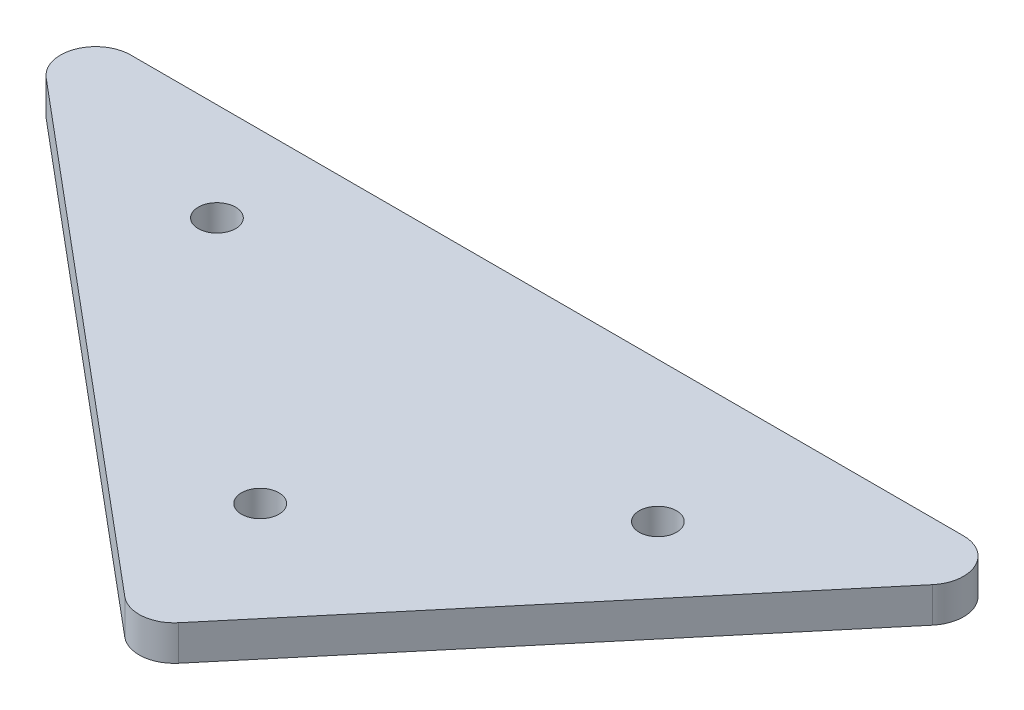
ISO-10303-21;
HEADER;
FILE_DESCRIPTION(('STEP AP214'),'2;1');
FILE_NAME('part.step','',(''),(''),'','','');
FILE_SCHEMA(('AUTOMOTIVE_DESIGN { 1 0 10303 214 1 1 1 1 }'));
ENDSEC;
DATA;
#1=APPLICATION_CONTEXT('core data for automotive mechanical design processes');
#2=APPLICATION_PROTOCOL_DEFINITION('international standard','automotive_design',2000,#1);
#3=PRODUCT_CONTEXT('',#1,'mechanical');
#4=PRODUCT('Part','Part','',(#3));
#5=PRODUCT_RELATED_PRODUCT_CATEGORY('part','',(#4));
#6=PRODUCT_DEFINITION_FORMATION('','',#4);
#7=PRODUCT_DEFINITION_CONTEXT('part definition',#1,'design');
#8=PRODUCT_DEFINITION('design','',#6,#7);
#9=PRODUCT_DEFINITION_SHAPE('','',#8);
#10=(LENGTH_UNIT() NAMED_UNIT(*) SI_UNIT(.MILLI.,.METRE.));
#11=(NAMED_UNIT(*) PLANE_ANGLE_UNIT() SI_UNIT($,.RADIAN.));
#12=(NAMED_UNIT(*) SI_UNIT($,.STERADIAN.) SOLID_ANGLE_UNIT());
#13=UNCERTAINTY_MEASURE_WITH_UNIT(LENGTH_MEASURE(1.E-05),#10,'distance_accuracy_value','');
#14=(GEOMETRIC_REPRESENTATION_CONTEXT(3) GLOBAL_UNCERTAINTY_ASSIGNED_CONTEXT((#13)) GLOBAL_UNIT_ASSIGNED_CONTEXT((#10,
#11,#12)) REPRESENTATION_CONTEXT('',''));
#15=CARTESIAN_POINT('',(0.,0.,0.));
#16=DIRECTION('',(0.,0.,1.));
#17=DIRECTION('',(1.,0.,0.));
#18=AXIS2_PLACEMENT_3D('',#15,#16,#17);
#19=CARTESIAN_POINT('',(189.795344434669,-158.75,127.));
#20=DIRECTION('',(0.,0.,1.));
#21=DIRECTION('',(1.,0.,0.));
#22=AXIS2_PLACEMENT_3D('',#19,#20,#21);
#23=PLANE('',#22);
#24=DIRECTION('',(-1.,0.,0.));
#25=VECTOR('',#24,1.);
#26=CARTESIAN_POINT('',(189.795344434669,-158.75,127.));
#27=LINE('',#26,#25);
#28=CARTESIAN_POINT('',(258.087229911123,-158.75,127.));
#29=VERTEX_POINT('',#28);
#30=CARTESIAN_POINT('',(107.476722517164,-158.75,127.));
#31=VERTEX_POINT('',#30);
#32=EDGE_CURVE('E104',#29,#31,#27,.T.);
#33=ORIENTED_EDGE('',*,*,#32,.F.);
#34=DIRECTION('',(0.,-1.,0.));
#35=VECTOR('',#34,1.);
#36=CARTESIAN_POINT('',(258.087229911123,-158.75,127.));
#37=LINE('',#36,#35);
#38=CARTESIAN_POINT('',(258.087229911123,-165.1,127.));
#39=VERTEX_POINT('',#38);
#40=EDGE_CURVE('E89',#29,#39,#37,.T.);
#41=ORIENTED_EDGE('',*,*,#40,.T.);
#42=DIRECTION('',(-1.,0.,0.));
#43=VECTOR('',#42,1.);
#44=CARTESIAN_POINT('',(189.795344434669,-165.1,127.));
#45=LINE('',#44,#43);
#46=CARTESIAN_POINT('',(107.476722517164,-165.1,127.));
#47=VERTEX_POINT('',#46);
#48=EDGE_CURVE('E102',#39,#47,#45,.T.);
#49=ORIENTED_EDGE('',*,*,#48,.T.);
#50=DIRECTION('',(0.,-1.,0.));
#51=VECTOR('',#50,1.);
#52=CARTESIAN_POINT('',(107.476722517164,-158.75,127.));
#53=LINE('',#52,#51);
#54=EDGE_CURVE('E107',#47,#31,#53,.F.);
#55=ORIENTED_EDGE('',*,*,#54,.T.);
#56=EDGE_LOOP('',(#33,#41,#49,#55));
#57=FACE_BOUND('',#56,.T.);
#58=ADVANCED_FACE('F14',(#57),#23,.F.);
#59=CARTESIAN_POINT('',(145.411840023669,-158.75,173.470679395635));
#60=DIRECTION('',(0.64278760968654,0.,-0.766044443118978));
#61=DIRECTION('',(-0.766044443118978,0.,-0.64278760968654));
#62=AXIS2_PLACEMENT_3D('',#59,#60,#61);
#63=PLANE('',#62);
#64=DIRECTION('',(0.766044443118978,0.,0.64278760968654));
#65=VECTOR('',#64,1.);
#66=CARTESIAN_POINT('',(145.411840023669,-165.1,173.470679395635));
#67=LINE('',#66,#65);
#68=CARTESIAN_POINT('',(103.395021195655,-165.1,138.214382213805));
#69=VERTEX_POINT('',#68);
#70=CARTESIAN_POINT('',(191.77689496586,-165.1,212.375579897142));
#71=VERTEX_POINT('',#70);
#72=EDGE_CURVE('E112',#69,#71,#67,.T.);
#73=ORIENTED_EDGE('',*,*,#72,.T.);
#74=DIRECTION('',(0.,-1.,0.));
#75=VECTOR('',#74,1.);
#76=CARTESIAN_POINT('',(191.77689496586,-158.75,212.375579897142));
#77=LINE('',#76,#75);
#78=CARTESIAN_POINT('',(191.77689496586,-158.75,212.375579897142));
#79=VERTEX_POINT('',#78);
#80=EDGE_CURVE('E9',#71,#79,#77,.F.);
#81=ORIENTED_EDGE('',*,*,#80,.T.);
#82=DIRECTION('',(0.766044443118978,0.,0.64278760968654));
#83=VECTOR('',#82,1.);
#84=CARTESIAN_POINT('',(145.411840023669,-158.75,173.470679395635));
#85=LINE('',#84,#83);
#86=CARTESIAN_POINT('',(103.395021195655,-158.75,138.214382213805));
#87=VERTEX_POINT('',#86);
#88=EDGE_CURVE('E141',#87,#79,#85,.T.);
#89=ORIENTED_EDGE('',*,*,#88,.F.);
#90=DIRECTION('',(0.,-1.,0.));
#91=VECTOR('',#90,1.);
#92=CARTESIAN_POINT('',(103.395021195655,-158.75,138.214382213805));
#93=LINE('',#92,#91);
#94=EDGE_CURVE('E23',#87,#69,#93,.T.);
#95=ORIENTED_EDGE('',*,*,#94,.T.);
#96=EDGE_LOOP('',(#73,#81,#89,#95));
#97=FACE_BOUND('',#96,.T.);
#98=ADVANCED_FACE('F162',(#97),#63,.F.);
#99=CARTESIAN_POINT('',(227.155076417816,-158.75,180.092351352888));
#100=DIRECTION('',(-0.766044443118978,0.,-0.64278760968654));
#101=DIRECTION('',(-0.64278760968654,0.,0.766044443118978));
#102=AXIS2_PLACEMENT_3D('',#99,#100,#101);
#103=PLANE('',#102);
#104=DIRECTION('',(0.64278760968654,0.,-0.766044443118978));
#105=VECTOR('',#104,1.);
#106=CARTESIAN_POINT('',(227.155076417816,-165.1,180.092351352888));
#107=LINE('',#106,#105);
#108=CARTESIAN_POINT('',(200.722978501176,-165.1,211.592899004846));
#109=VERTEX_POINT('',#108);
#110=CARTESIAN_POINT('',(262.951612124928,-165.1,137.431701321509));
#111=VERTEX_POINT('',#110);
#112=EDGE_CURVE('E113',#109,#111,#107,.T.);
#113=ORIENTED_EDGE('',*,*,#112,.T.);
#114=DIRECTION('',(0.,-1.,0.));
#115=VECTOR('',#114,1.);
#116=CARTESIAN_POINT('',(262.951612124928,-158.75,137.431701321509));
#117=LINE('',#116,#115);
#118=CARTESIAN_POINT('',(262.951612124928,-158.75,137.431701321509));
#119=VERTEX_POINT('',#118);
#120=EDGE_CURVE('E90',#111,#119,#117,.F.);
#121=ORIENTED_EDGE('',*,*,#120,.T.);
#122=DIRECTION('',(0.64278760968654,0.,-0.766044443118978));
#123=VECTOR('',#122,1.);
#124=CARTESIAN_POINT('',(227.155076417816,-158.75,180.092351352888));
#125=LINE('',#124,#123);
#126=CARTESIAN_POINT('',(200.722978501176,-158.75,211.592899004846));
#127=VERTEX_POINT('',#126);
#128=EDGE_CURVE('E119',#127,#119,#125,.T.);
#129=ORIENTED_EDGE('',*,*,#128,.F.);
#130=DIRECTION('',(0.,-1.,0.));
#131=VECTOR('',#130,1.);
#132=CARTESIAN_POINT('',(200.722978501176,-158.75,211.592899004846));
#133=LINE('',#132,#131);
#134=EDGE_CURVE('E96',#127,#109,#133,.T.);
#135=ORIENTED_EDGE('',*,*,#134,.T.);
#136=EDGE_LOOP('',(#113,#121,#129,#135));
#137=FACE_BOUND('',#136,.T.);
#138=ADVANCED_FACE('F170',(#137),#103,.F.);
#139=CARTESIAN_POINT('',(705.053366952356,-158.75,637.655198226429));
#140=DIRECTION('',(0.,1.,0.));
#141=DIRECTION('',(-1.,0.,0.));
#142=AXIS2_PLACEMENT_3D('',#139,#140,#141);
#143=PLANE('',#142);
#144=CARTESIAN_POINT('',(140.785030150917,-158.75,144.720316076102));
#145=DIRECTION('',(0.,1.,0.));
#146=DIRECTION('',(0.,0.,1.));
#147=AXIS2_PLACEMENT_3D('',#144,#145,#146);
#148=CIRCLE('',#147,3.3782);
#149=CARTESIAN_POINT('',(140.785030150917,-158.75,148.098516076102));
#150=VERTEX_POINT('',#149);
#151=EDGE_CURVE('E135',#150,#150,#148,.F.);
#152=ORIENTED_EDGE('',*,*,#151,.T.);
#153=EDGE_LOOP('',(#152));
#154=FACE_BOUND('',#153,.T.);
#155=CARTESIAN_POINT('',(228.210699023183,-158.75,152.4));
#156=DIRECTION('',(0.,1.,0.));
#157=DIRECTION('',(0.,0.,1.));
#158=AXIS2_PLACEMENT_3D('',#155,#156,#157);
#159=CIRCLE('',#158,3.3782);
#160=CARTESIAN_POINT('',(228.210699023183,-158.75,155.7782));
#161=VERTEX_POINT('',#160);
#162=EDGE_CURVE('E130',#161,#161,#159,.F.);
#163=ORIENTED_EDGE('',*,*,#162,.T.);
#164=EDGE_LOOP('',(#163));
#165=FACE_BOUND('',#164,.T.);
#166=CARTESIAN_POINT('',(189.428852288973,-158.75,185.537329291197));
#167=DIRECTION('',(0.,1.,0.));
#168=DIRECTION('',(0.,0.,1.));
#169=AXIS2_PLACEMENT_3D('',#166,#167,#168);
#170=CIRCLE('',#169,3.3782);
#171=CARTESIAN_POINT('',(189.428852288973,-158.75,188.915529291197));
#172=VERTEX_POINT('',#171);
#173=EDGE_CURVE('E122',#172,#172,#170,.F.);
#174=ORIENTED_EDGE('',*,*,#173,.T.);
#175=EDGE_LOOP('',(#174));
#176=FACE_BOUND('',#175,.T.);
#177=ORIENTED_EDGE('',*,*,#128,.T.);
#178=CARTESIAN_POINT('',(258.087229911123,-158.75,133.35));
#179=DIRECTION('',(0.,1.,0.));
#180=DIRECTION('',(0.,0.,1.));
#181=AXIS2_PLACEMENT_3D('',#178,#179,#180);
#182=CIRCLE('',#181,6.35);
#183=EDGE_CURVE('E156',#119,#29,#182,.T.);
#184=ORIENTED_EDGE('',*,*,#183,.T.);
#185=ORIENTED_EDGE('',*,*,#32,.T.);
#186=CARTESIAN_POINT('',(107.476722517164,-158.75,133.35));
#187=DIRECTION('',(0.,1.,0.));
#188=DIRECTION('',(0.,0.,1.));
#189=AXIS2_PLACEMENT_3D('',#186,#187,#188);
#190=CIRCLE('',#189,6.35);
#191=EDGE_CURVE('E43',#31,#87,#190,.T.);
#192=ORIENTED_EDGE('',*,*,#191,.T.);
#193=ORIENTED_EDGE('',*,*,#88,.T.);
#194=CARTESIAN_POINT('',(195.85859628737,-158.75,207.511197683337));
#195=DIRECTION('',(0.,1.,0.));
#196=DIRECTION('',(0.,0.,1.));
#197=AXIS2_PLACEMENT_3D('',#194,#195,#196);
#198=CIRCLE('',#197,6.35);
#199=EDGE_CURVE('E154',#79,#127,#198,.T.);
#200=ORIENTED_EDGE('',*,*,#199,.T.);
#201=EDGE_LOOP('',(#177,#184,#185,#192,#193,#200));
#202=FACE_BOUND('',#201,.T.);
#203=ADVANCED_FACE('F181',(#154,#165,#176,#202),#143,.T.);
#204=CARTESIAN_POINT('',(705.053366952356,-165.1,637.655198226429));
#205=DIRECTION('',(0.,1.,0.));
#206=DIRECTION('',(-1.,0.,0.));
#207=AXIS2_PLACEMENT_3D('',#204,#205,#206);
#208=PLANE('',#207);
#209=CARTESIAN_POINT('',(140.785030150917,-165.1,144.720316076102));
#210=DIRECTION('',(0.,-1.,0.));
#211=DIRECTION('',(0.,0.,-1.));
#212=AXIS2_PLACEMENT_3D('',#209,#210,#211);
#213=CIRCLE('',#212,3.3782);
#214=CARTESIAN_POINT('',(140.785030150917,-165.1,141.342116076102));
#215=VERTEX_POINT('',#214);
#216=EDGE_CURVE('E139',#215,#215,#213,.T.);
#217=ORIENTED_EDGE('',*,*,#216,.F.);
#218=EDGE_LOOP('',(#217));
#219=FACE_BOUND('',#218,.T.);
#220=CARTESIAN_POINT('',(228.210699023183,-165.1,152.4));
#221=DIRECTION('',(0.,-1.,0.));
#222=DIRECTION('',(0.,0.,-1.));
#223=AXIS2_PLACEMENT_3D('',#220,#221,#222);
#224=CIRCLE('',#223,3.3782);
#225=CARTESIAN_POINT('',(228.210699023183,-165.1,149.0218));
#226=VERTEX_POINT('',#225);
#227=EDGE_CURVE('E134',#226,#226,#224,.T.);
#228=ORIENTED_EDGE('',*,*,#227,.F.);
#229=EDGE_LOOP('',(#228));
#230=FACE_BOUND('',#229,.T.);
#231=CARTESIAN_POINT('',(189.428852288973,-165.1,185.537329291197));
#232=DIRECTION('',(0.,-1.,0.));
#233=DIRECTION('',(0.,0.,-1.));
#234=AXIS2_PLACEMENT_3D('',#231,#232,#233);
#235=CIRCLE('',#234,3.3782);
#236=CARTESIAN_POINT('',(189.428852288973,-165.1,182.159129291197));
#237=VERTEX_POINT('',#236);
#238=EDGE_CURVE('E129',#237,#237,#235,.T.);
#239=ORIENTED_EDGE('',*,*,#238,.F.);
#240=EDGE_LOOP('',(#239));
#241=FACE_BOUND('',#240,.T.);
#242=ORIENTED_EDGE('',*,*,#48,.F.);
#243=CARTESIAN_POINT('',(258.087229911123,-165.1,133.35));
#244=DIRECTION('',(0.,1.,0.));
#245=DIRECTION('',(0.,0.,1.));
#246=AXIS2_PLACEMENT_3D('',#243,#244,#245);
#247=CIRCLE('',#246,6.35);
#248=EDGE_CURVE('E85',#39,#111,#247,.F.);
#249=ORIENTED_EDGE('',*,*,#248,.T.);
#250=ORIENTED_EDGE('',*,*,#112,.F.);
#251=CARTESIAN_POINT('',(195.85859628737,-165.1,207.511197683337));
#252=DIRECTION('',(0.,1.,0.));
#253=DIRECTION('',(0.,0.,1.));
#254=AXIS2_PLACEMENT_3D('',#251,#252,#253);
#255=CIRCLE('',#254,6.35);
#256=EDGE_CURVE('E97',#109,#71,#255,.F.);
#257=ORIENTED_EDGE('',*,*,#256,.T.);
#258=ORIENTED_EDGE('',*,*,#72,.F.);
#259=CARTESIAN_POINT('',(107.476722517164,-165.1,133.35));
#260=DIRECTION('',(0.,1.,0.));
#261=DIRECTION('',(0.,0.,1.));
#262=AXIS2_PLACEMENT_3D('',#259,#260,#261);
#263=CIRCLE('',#262,6.35);
#264=EDGE_CURVE('E106',#69,#47,#263,.F.);
#265=ORIENTED_EDGE('',*,*,#264,.T.);
#266=EDGE_LOOP('',(#242,#249,#250,#257,#258,#265));
#267=FACE_BOUND('',#266,.T.);
#268=ADVANCED_FACE('F109',(#219,#230,#241,#267),#208,.F.);
#269=CARTESIAN_POINT('',(189.428852288973,38.5194319771191,185.537329291197));
#270=DIRECTION('',(0.,-1.,0.));
#271=DIRECTION('',(0.,0.,-1.));
#272=AXIS2_PLACEMENT_3D('',#269,#270,#271);
#273=CYLINDRICAL_SURFACE('',#272,3.3782);
#274=ORIENTED_EDGE('',*,*,#173,.F.);
#275=EDGE_LOOP('',(#274));
#276=FACE_BOUND('',#275,.T.);
#277=ORIENTED_EDGE('',*,*,#238,.T.);
#278=EDGE_LOOP('',(#277));
#279=FACE_BOUND('',#278,.T.);
#280=ADVANCED_FACE('F190',(#276,#279),#273,.F.);
#281=CARTESIAN_POINT('',(228.210699023183,38.5194319771191,152.4));
#282=DIRECTION('',(0.,-1.,0.));
#283=DIRECTION('',(0.,0.,-1.));
#284=AXIS2_PLACEMENT_3D('',#281,#282,#283);
#285=CYLINDRICAL_SURFACE('',#284,3.3782);
#286=ORIENTED_EDGE('',*,*,#162,.F.);
#287=EDGE_LOOP('',(#286));
#288=FACE_BOUND('',#287,.T.);
#289=ORIENTED_EDGE('',*,*,#227,.T.);
#290=EDGE_LOOP('',(#289));
#291=FACE_BOUND('',#290,.T.);
#292=ADVANCED_FACE('F237',(#288,#291),#285,.F.);
#293=CARTESIAN_POINT('',(140.785030150917,38.5194319771191,144.720316076102));
#294=DIRECTION('',(0.,-1.,0.));
#295=DIRECTION('',(0.,0.,-1.));
#296=AXIS2_PLACEMENT_3D('',#293,#294,#295);
#297=CYLINDRICAL_SURFACE('',#296,3.3782);
#298=ORIENTED_EDGE('',*,*,#151,.F.);
#299=EDGE_LOOP('',(#298));
#300=FACE_BOUND('',#299,.T.);
#301=ORIENTED_EDGE('',*,*,#216,.T.);
#302=EDGE_LOOP('',(#301));
#303=FACE_BOUND('',#302,.T.);
#304=ADVANCED_FACE('F204',(#300,#303),#297,.F.);
#305=CARTESIAN_POINT('',(258.087229911123,-158.75,133.35));
#306=DIRECTION('',(0.,-1.,0.));
#307=DIRECTION('',(0.,0.,-1.));
#308=AXIS2_PLACEMENT_3D('',#305,#306,#307);
#309=CYLINDRICAL_SURFACE('',#308,6.35);
#310=ORIENTED_EDGE('',*,*,#183,.F.);
#311=ORIENTED_EDGE('',*,*,#120,.F.);
#312=ORIENTED_EDGE('',*,*,#248,.F.);
#313=ORIENTED_EDGE('',*,*,#40,.F.);
#314=EDGE_LOOP('',(#310,#311,#312,#313));
#315=FACE_BOUND('',#314,.T.);
#316=ADVANCED_FACE('F88',(#315),#309,.T.);
#317=CARTESIAN_POINT('',(195.85859628737,-158.75,207.511197683337));
#318=DIRECTION('',(0.,-1.,0.));
#319=DIRECTION('',(0.,0.,-1.));
#320=AXIS2_PLACEMENT_3D('',#317,#318,#319);
#321=CYLINDRICAL_SURFACE('',#320,6.35);
#322=ORIENTED_EDGE('',*,*,#199,.F.);
#323=ORIENTED_EDGE('',*,*,#80,.F.);
#324=ORIENTED_EDGE('',*,*,#256,.F.);
#325=ORIENTED_EDGE('',*,*,#134,.F.);
#326=EDGE_LOOP('',(#322,#323,#324,#325));
#327=FACE_BOUND('',#326,.T.);
#328=ADVANCED_FACE('F167',(#327),#321,.T.);
#329=CARTESIAN_POINT('',(107.476722517164,-158.75,133.35));
#330=DIRECTION('',(0.,-1.,0.));
#331=DIRECTION('',(0.,0.,-1.));
#332=AXIS2_PLACEMENT_3D('',#329,#330,#331);
#333=CYLINDRICAL_SURFACE('',#332,6.35);
#334=ORIENTED_EDGE('',*,*,#191,.F.);
#335=ORIENTED_EDGE('',*,*,#54,.F.);
#336=ORIENTED_EDGE('',*,*,#264,.F.);
#337=ORIENTED_EDGE('',*,*,#94,.F.);
#338=EDGE_LOOP('',(#334,#335,#336,#337));
#339=FACE_BOUND('',#338,.T.);
#340=ADVANCED_FACE('F16',(#339),#333,.T.);
#341=CLOSED_SHELL('',(#58,#98,#138,#203,#268,#280,#292,#304,#316,#328,#340));
#342=MANIFOLD_SOLID_BREP('B1',#341);
#343=ADVANCED_BREP_SHAPE_REPRESENTATION('',(#18,#342),#14);
#344=SHAPE_DEFINITION_REPRESENTATION(#9,#343);
ENDSEC;
END-ISO-10303-21;
